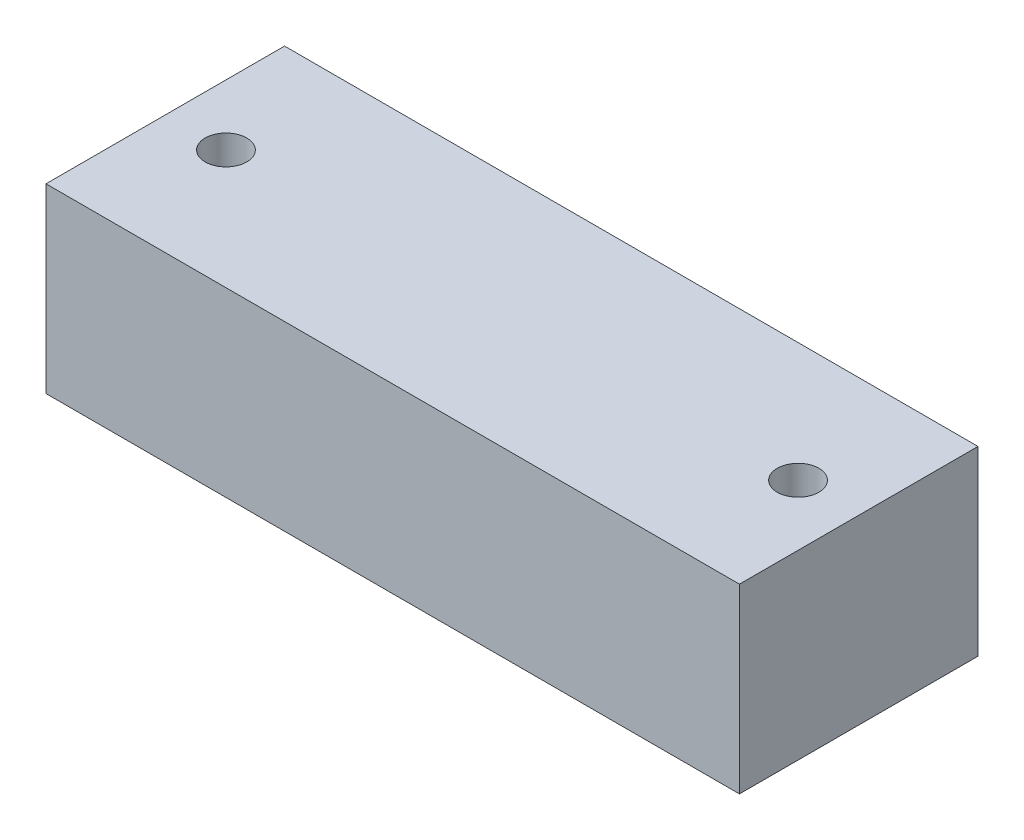
ISO-10303-21;
HEADER;
FILE_DESCRIPTION(('STEP AP214'),'2;1');
FILE_NAME('part.step','',(''),(''),'','','');
FILE_SCHEMA(('AUTOMOTIVE_DESIGN { 1 0 10303 214 1 1 1 1 }'));
ENDSEC;
DATA;
#1=APPLICATION_CONTEXT('core data for automotive mechanical design processes');
#2=APPLICATION_PROTOCOL_DEFINITION('international standard','automotive_design',2000,#1);
#3=PRODUCT_CONTEXT('',#1,'mechanical');
#4=PRODUCT('Part','Part','',(#3));
#5=PRODUCT_RELATED_PRODUCT_CATEGORY('part','',(#4));
#6=PRODUCT_DEFINITION_FORMATION('','',#4);
#7=PRODUCT_DEFINITION_CONTEXT('part definition',#1,'design');
#8=PRODUCT_DEFINITION('design','',#6,#7);
#9=PRODUCT_DEFINITION_SHAPE('','',#8);
#10=(LENGTH_UNIT() NAMED_UNIT(*) SI_UNIT(.MILLI.,.METRE.));
#11=(NAMED_UNIT(*) PLANE_ANGLE_UNIT() SI_UNIT($,.RADIAN.));
#12=(NAMED_UNIT(*) SI_UNIT($,.STERADIAN.) SOLID_ANGLE_UNIT());
#13=UNCERTAINTY_MEASURE_WITH_UNIT(LENGTH_MEASURE(1.E-05),#10,'distance_accuracy_value','');
#14=(GEOMETRIC_REPRESENTATION_CONTEXT(3) GLOBAL_UNCERTAINTY_ASSIGNED_CONTEXT((#13)) GLOBAL_UNIT_ASSIGNED_CONTEXT((#10,
#11,#12)) REPRESENTATION_CONTEXT('',''));
#15=CARTESIAN_POINT('',(0.,0.,0.));
#16=DIRECTION('',(0.,0.,1.));
#17=DIRECTION('',(1.,0.,0.));
#18=AXIS2_PLACEMENT_3D('',#15,#16,#17);
#19=CARTESIAN_POINT('',(0.,16.637,0.));
#20=DIRECTION('',(0.,-1.,0.));
#21=DIRECTION('',(0.,0.,-1.));
#22=AXIS2_PLACEMENT_3D('',#19,#20,#21);
#23=PLANE('',#22);
#24=DIRECTION('',(0.,0.,1.));
#25=VECTOR('',#24,1.);
#26=CARTESIAN_POINT('',(0.,16.637,0.));
#27=LINE('',#26,#25);
#28=CARTESIAN_POINT('',(0.,16.637,-21.844));
#29=VERTEX_POINT('',#28);
#30=CARTESIAN_POINT('',(0.,16.637,0.));
#31=VERTEX_POINT('',#30);
#32=EDGE_CURVE('E96',#29,#31,#27,.T.);
#33=ORIENTED_EDGE('',*,*,#32,.T.);
#34=DIRECTION('',(1.,0.,0.));
#35=VECTOR('',#34,1.);
#36=CARTESIAN_POINT('',(0.,16.637,0.));
#37=LINE('',#36,#35);
#38=CARTESIAN_POINT('',(63.4999999999999,16.637,0.));
#39=VERTEX_POINT('',#38);
#40=EDGE_CURVE('E91',#31,#39,#37,.T.);
#41=ORIENTED_EDGE('',*,*,#40,.T.);
#42=DIRECTION('',(0.,0.,-1.));
#43=VECTOR('',#42,1.);
#44=CARTESIAN_POINT('',(63.4999999999999,16.637,0.));
#45=LINE('',#44,#43);
#46=CARTESIAN_POINT('',(63.4999999999999,16.637,-21.844));
#47=VERTEX_POINT('',#46);
#48=EDGE_CURVE('E94',#39,#47,#45,.T.);
#49=ORIENTED_EDGE('',*,*,#48,.T.);
#50=DIRECTION('',(-1.,0.,0.));
#51=VECTOR('',#50,1.);
#52=CARTESIAN_POINT('',(0.,16.637,-21.844));
#53=LINE('',#52,#51);
#54=EDGE_CURVE('E61',#47,#29,#53,.T.);
#55=ORIENTED_EDGE('',*,*,#54,.T.);
#56=EDGE_LOOP('',(#33,#41,#49,#55));
#57=FACE_BOUND('',#56,.T.);
#58=CARTESIAN_POINT('',(5.55625,16.637,-10.922));
#59=DIRECTION('',(0.,1.,0.));
#60=DIRECTION('',(0.,0.,1.));
#61=AXIS2_PLACEMENT_3D('',#58,#59,#60);
#62=CIRCLE('',#61,1.905);
#63=CARTESIAN_POINT('',(5.55625,16.637,-9.017));
#64=VERTEX_POINT('',#63);
#65=EDGE_CURVE('E111',#64,#64,#62,.T.);
#66=ORIENTED_EDGE('',*,*,#65,.F.);
#67=EDGE_LOOP('',(#66));
#68=FACE_BOUND('',#67,.T.);
#69=CARTESIAN_POINT('',(57.94375,16.637,-10.922));
#70=DIRECTION('',(0.,1.,0.));
#71=DIRECTION('',(0.,0.,1.));
#72=AXIS2_PLACEMENT_3D('',#69,#70,#71);
#73=CIRCLE('',#72,1.905);
#74=CARTESIAN_POINT('',(57.94375,16.637,-9.017));
#75=VERTEX_POINT('',#74);
#76=EDGE_CURVE('E126',#75,#75,#73,.T.);
#77=ORIENTED_EDGE('',*,*,#76,.F.);
#78=EDGE_LOOP('',(#77));
#79=FACE_BOUND('',#78,.T.);
#80=ADVANCED_FACE('F44',(#57,#68,#79),#23,.F.);
#81=CARTESIAN_POINT('',(0.,0.,0.));
#82=DIRECTION('',(0.,-1.,0.));
#83=DIRECTION('',(0.,0.,-1.));
#84=AXIS2_PLACEMENT_3D('',#81,#82,#83);
#85=PLANE('',#84);
#86=CARTESIAN_POINT('',(5.55625,0.,-10.922));
#87=DIRECTION('',(0.,1.,0.));
#88=DIRECTION('',(0.,0.,1.));
#89=AXIS2_PLACEMENT_3D('',#86,#87,#88);
#90=CIRCLE('',#89,1.905);
#91=CARTESIAN_POINT('',(5.55625,0.,-9.017));
#92=VERTEX_POINT('',#91);
#93=EDGE_CURVE('E123',#92,#92,#90,.T.);
#94=ORIENTED_EDGE('',*,*,#93,.T.);
#95=EDGE_LOOP('',(#94));
#96=FACE_BOUND('',#95,.T.);
#97=DIRECTION('',(0.,0.,1.));
#98=VECTOR('',#97,1.);
#99=CARTESIAN_POINT('',(0.,0.,0.));
#100=LINE('',#99,#98);
#101=CARTESIAN_POINT('',(0.,0.,-21.844));
#102=VERTEX_POINT('',#101);
#103=CARTESIAN_POINT('',(0.,0.,0.));
#104=VERTEX_POINT('',#103);
#105=EDGE_CURVE('E108',#102,#104,#100,.T.);
#106=ORIENTED_EDGE('',*,*,#105,.F.);
#107=DIRECTION('',(-1.,0.,0.));
#108=VECTOR('',#107,1.);
#109=CARTESIAN_POINT('',(0.,0.,-21.844));
#110=LINE('',#109,#108);
#111=CARTESIAN_POINT('',(63.4999999999999,0.,-21.844));
#112=VERTEX_POINT('',#111);
#113=EDGE_CURVE('E84',#112,#102,#110,.T.);
#114=ORIENTED_EDGE('',*,*,#113,.F.);
#115=DIRECTION('',(0.,0.,-1.));
#116=VECTOR('',#115,1.);
#117=CARTESIAN_POINT('',(63.4999999999999,0.,0.));
#118=LINE('',#117,#116);
#119=CARTESIAN_POINT('',(63.4999999999999,0.,0.));
#120=VERTEX_POINT('',#119);
#121=EDGE_CURVE('E78',#120,#112,#118,.T.);
#122=ORIENTED_EDGE('',*,*,#121,.F.);
#123=DIRECTION('',(1.,0.,0.));
#124=VECTOR('',#123,1.);
#125=CARTESIAN_POINT('',(0.,0.,0.));
#126=LINE('',#125,#124);
#127=EDGE_CURVE('E100',#104,#120,#126,.T.);
#128=ORIENTED_EDGE('',*,*,#127,.F.);
#129=EDGE_LOOP('',(#106,#114,#122,#128));
#130=FACE_BOUND('',#129,.T.);
#131=CARTESIAN_POINT('',(57.94375,0.,-10.922));
#132=DIRECTION('',(0.,1.,0.));
#133=DIRECTION('',(0.,0.,1.));
#134=AXIS2_PLACEMENT_3D('',#131,#132,#133);
#135=CIRCLE('',#134,1.905);
#136=CARTESIAN_POINT('',(57.94375,0.,-9.017));
#137=VERTEX_POINT('',#136);
#138=EDGE_CURVE('E129',#137,#137,#135,.T.);
#139=ORIENTED_EDGE('',*,*,#138,.T.);
#140=EDGE_LOOP('',(#139));
#141=FACE_BOUND('',#140,.T.);
#142=ADVANCED_FACE('F119',(#96,#130,#141),#85,.T.);
#143=CARTESIAN_POINT('',(0.,16.637,0.));
#144=DIRECTION('',(1.,0.,0.));
#145=DIRECTION('',(0.,0.,-1.));
#146=AXIS2_PLACEMENT_3D('',#143,#144,#145);
#147=PLANE('',#146);
#148=ORIENTED_EDGE('',*,*,#105,.T.);
#149=DIRECTION('',(0.,-1.,0.));
#150=VECTOR('',#149,1.);
#151=CARTESIAN_POINT('',(0.,16.637,0.));
#152=LINE('',#151,#150);
#153=EDGE_CURVE('E13',#31,#104,#152,.T.);
#154=ORIENTED_EDGE('',*,*,#153,.F.);
#155=ORIENTED_EDGE('',*,*,#32,.F.);
#156=DIRECTION('',(0.,-1.,0.));
#157=VECTOR('',#156,1.);
#158=CARTESIAN_POINT('',(0.,16.637,-21.844));
#159=LINE('',#158,#157);
#160=EDGE_CURVE('E104',#29,#102,#159,.T.);
#161=ORIENTED_EDGE('',*,*,#160,.T.);
#162=EDGE_LOOP('',(#148,#154,#155,#161));
#163=FACE_BOUND('',#162,.T.);
#164=ADVANCED_FACE('F46',(#163),#147,.F.);
#165=CARTESIAN_POINT('',(0.,16.637,0.));
#166=DIRECTION('',(0.,0.,-1.));
#167=DIRECTION('',(-1.,0.,0.));
#168=AXIS2_PLACEMENT_3D('',#165,#166,#167);
#169=PLANE('',#168);
#170=ORIENTED_EDGE('',*,*,#127,.T.);
#171=DIRECTION('',(0.,-1.,0.));
#172=VECTOR('',#171,1.);
#173=CARTESIAN_POINT('',(63.4999999999999,16.637,0.));
#174=LINE('',#173,#172);
#175=EDGE_CURVE('E53',#39,#120,#174,.T.);
#176=ORIENTED_EDGE('',*,*,#175,.F.);
#177=ORIENTED_EDGE('',*,*,#40,.F.);
#178=ORIENTED_EDGE('',*,*,#153,.T.);
#179=EDGE_LOOP('',(#170,#176,#177,#178));
#180=FACE_BOUND('',#179,.T.);
#181=ADVANCED_FACE('F99',(#180),#169,.F.);
#182=CARTESIAN_POINT('',(63.4999999999999,16.637,0.));
#183=DIRECTION('',(-1.,0.,0.));
#184=DIRECTION('',(0.,0.,1.));
#185=AXIS2_PLACEMENT_3D('',#182,#183,#184);
#186=PLANE('',#185);
#187=ORIENTED_EDGE('',*,*,#121,.T.);
#188=DIRECTION('',(0.,-1.,0.));
#189=VECTOR('',#188,1.);
#190=CARTESIAN_POINT('',(63.4999999999999,16.637,-21.844));
#191=LINE('',#190,#189);
#192=EDGE_CURVE('E101',#47,#112,#191,.T.);
#193=ORIENTED_EDGE('',*,*,#192,.F.);
#194=ORIENTED_EDGE('',*,*,#48,.F.);
#195=ORIENTED_EDGE('',*,*,#175,.T.);
#196=EDGE_LOOP('',(#187,#193,#194,#195));
#197=FACE_BOUND('',#196,.T.);
#198=ADVANCED_FACE('F102',(#197),#186,.F.);
#199=CARTESIAN_POINT('',(0.,16.637,-21.844));
#200=DIRECTION('',(0.,0.,1.));
#201=DIRECTION('',(1.,0.,0.));
#202=AXIS2_PLACEMENT_3D('',#199,#200,#201);
#203=PLANE('',#202);
#204=ORIENTED_EDGE('',*,*,#113,.T.);
#205=ORIENTED_EDGE('',*,*,#160,.F.);
#206=ORIENTED_EDGE('',*,*,#54,.F.);
#207=ORIENTED_EDGE('',*,*,#192,.T.);
#208=EDGE_LOOP('',(#204,#205,#206,#207));
#209=FACE_BOUND('',#208,.T.);
#210=ADVANCED_FACE('F116',(#209),#203,.F.);
#211=CARTESIAN_POINT('',(5.55625,16.637,-10.922));
#212=DIRECTION('',(0.,-1.,0.));
#213=DIRECTION('',(0.,0.,-1.));
#214=AXIS2_PLACEMENT_3D('',#211,#212,#213);
#215=CYLINDRICAL_SURFACE('',#214,1.905);
#216=ORIENTED_EDGE('',*,*,#65,.T.);
#217=EDGE_LOOP('',(#216));
#218=FACE_BOUND('',#217,.T.);
#219=ORIENTED_EDGE('',*,*,#93,.F.);
#220=EDGE_LOOP('',(#219));
#221=FACE_BOUND('',#220,.T.);
#222=ADVANCED_FACE('F146',(#218,#221),#215,.F.);
#223=CARTESIAN_POINT('',(57.94375,16.637,-10.922));
#224=DIRECTION('',(0.,-1.,0.));
#225=DIRECTION('',(0.,0.,-1.));
#226=AXIS2_PLACEMENT_3D('',#223,#224,#225);
#227=CYLINDRICAL_SURFACE('',#226,1.905);
#228=ORIENTED_EDGE('',*,*,#76,.T.);
#229=EDGE_LOOP('',(#228));
#230=FACE_BOUND('',#229,.T.);
#231=ORIENTED_EDGE('',*,*,#138,.F.);
#232=EDGE_LOOP('',(#231));
#233=FACE_BOUND('',#232,.T.);
#234=ADVANCED_FACE('F135',(#230,#233),#227,.F.);
#235=CLOSED_SHELL('',(#80,#142,#164,#181,#198,#210,#222,#234));
#236=MANIFOLD_SOLID_BREP('B2',#235);
#237=ADVANCED_BREP_SHAPE_REPRESENTATION('',(#18,#236),#14);
#238=SHAPE_DEFINITION_REPRESENTATION(#9,#237);
ENDSEC;
END-ISO-10303-21;
